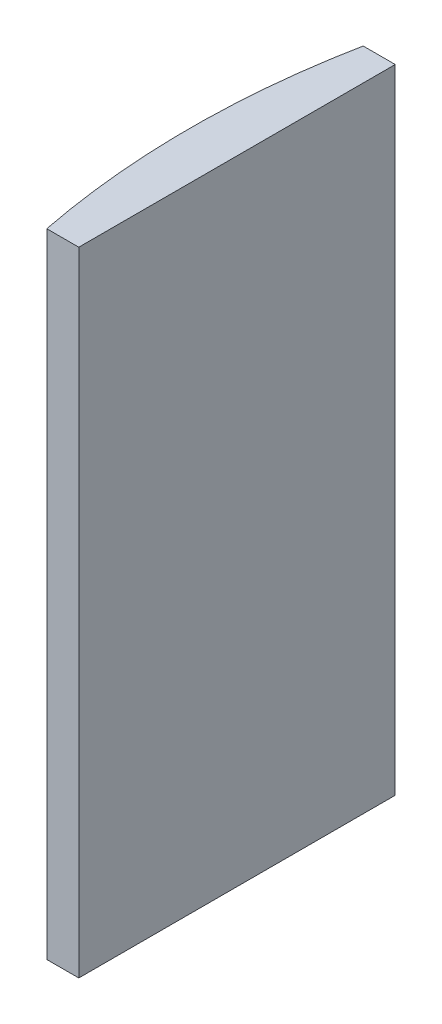
ISO-10303-21;
HEADER;
FILE_DESCRIPTION(('STEP AP214'),'2;1');
FILE_NAME('part.step','',(''),(''),'','','');
FILE_SCHEMA(('AUTOMOTIVE_DESIGN { 1 0 10303 214 1 1 1 1 }'));
ENDSEC;
DATA;
#1=APPLICATION_CONTEXT('core data for automotive mechanical design processes');
#2=APPLICATION_PROTOCOL_DEFINITION('international standard','automotive_design',2000,#1);
#3=PRODUCT_CONTEXT('',#1,'mechanical');
#4=PRODUCT('Part','Part','',(#3));
#5=PRODUCT_RELATED_PRODUCT_CATEGORY('part','',(#4));
#6=PRODUCT_DEFINITION_FORMATION('','',#4);
#7=PRODUCT_DEFINITION_CONTEXT('part definition',#1,'design');
#8=PRODUCT_DEFINITION('design','',#6,#7);
#9=PRODUCT_DEFINITION_SHAPE('','',#8);
#10=(LENGTH_UNIT() NAMED_UNIT(*) SI_UNIT(.MILLI.,.METRE.));
#11=(NAMED_UNIT(*) PLANE_ANGLE_UNIT() SI_UNIT($,.RADIAN.));
#12=(NAMED_UNIT(*) SI_UNIT($,.STERADIAN.) SOLID_ANGLE_UNIT());
#13=UNCERTAINTY_MEASURE_WITH_UNIT(LENGTH_MEASURE(1.E-05),#10,'distance_accuracy_value','');
#14=(GEOMETRIC_REPRESENTATION_CONTEXT(3) GLOBAL_UNCERTAINTY_ASSIGNED_CONTEXT((#13)) GLOBAL_UNIT_ASSIGNED_CONTEXT((#10,
#11,#12)) REPRESENTATION_CONTEXT('',''));
#15=CARTESIAN_POINT('',(0.,0.,0.));
#16=DIRECTION('',(0.,0.,1.));
#17=DIRECTION('',(1.,0.,0.));
#18=AXIS2_PLACEMENT_3D('',#15,#16,#17);
#19=CARTESIAN_POINT('',(4.35520433485127,60.,0.));
#20=DIRECTION('',(0.,-1.,0.));
#21=DIRECTION('',(0.,0.,-1.));
#22=AXIS2_PLACEMENT_3D('',#19,#20,#21);
#23=CYLINDRICAL_SURFACE('',#22,77.55);
#24=CARTESIAN_POINT('',(4.35520433485127,0.,0.));
#25=DIRECTION('',(0.,1.,0.));
#26=DIRECTION('',(0.,0.,1.));
#27=AXIS2_PLACEMENT_3D('',#24,#25,#26);
#28=CIRCLE('',#27,77.55);
#29=CARTESIAN_POINT('',(-71.7302903405466,0.,-15.));
#30=VERTEX_POINT('',#29);
#31=CARTESIAN_POINT('',(-71.7302903405466,0.,15.));
#32=VERTEX_POINT('',#31);
#33=EDGE_CURVE('E100',#30,#32,#28,.T.);
#34=ORIENTED_EDGE('',*,*,#33,.T.);
#35=DIRECTION('',(0.,-1.,0.));
#36=VECTOR('',#35,1.);
#37=CARTESIAN_POINT('',(-71.7302903405466,60.,15.));
#38=LINE('',#37,#36);
#39=CARTESIAN_POINT('',(-71.7302903405466,60.,15.));
#40=VERTEX_POINT('',#39);
#41=EDGE_CURVE('E11',#40,#32,#38,.T.);
#42=ORIENTED_EDGE('',*,*,#41,.F.);
#43=CARTESIAN_POINT('',(4.35520433485127,60.,0.));
#44=DIRECTION('',(0.,1.,0.));
#45=DIRECTION('',(0.,0.,1.));
#46=AXIS2_PLACEMENT_3D('',#43,#44,#45);
#47=CIRCLE('',#46,77.55);
#48=CARTESIAN_POINT('',(-71.7302903405466,60.,-15.));
#49=VERTEX_POINT('',#48);
#50=EDGE_CURVE('E88',#49,#40,#47,.T.);
#51=ORIENTED_EDGE('',*,*,#50,.F.);
#52=DIRECTION('',(0.,-1.,0.));
#53=VECTOR('',#52,1.);
#54=CARTESIAN_POINT('',(-71.7302903405466,60.,-15.));
#55=LINE('',#54,#53);
#56=EDGE_CURVE('E96',#49,#30,#55,.T.);
#57=ORIENTED_EDGE('',*,*,#56,.T.);
#58=EDGE_LOOP('',(#34,#42,#51,#57));
#59=FACE_BOUND('',#58,.T.);
#60=ADVANCED_FACE('F37',(#59),#23,.T.);
#61=CARTESIAN_POINT('',(-71.7302903405466,60.,15.));
#62=DIRECTION('',(0.,0.,-1.));
#63=DIRECTION('',(-1.,0.,0.));
#64=AXIS2_PLACEMENT_3D('',#61,#62,#63);
#65=PLANE('',#64);
#66=DIRECTION('',(1.,0.,0.));
#67=VECTOR('',#66,1.);
#68=CARTESIAN_POINT('',(-71.7302903405466,0.,15.));
#69=LINE('',#68,#67);
#70=CARTESIAN_POINT('',(-68.6947956651487,0.,15.));
#71=VERTEX_POINT('',#70);
#72=EDGE_CURVE('E92',#32,#71,#69,.T.);
#73=ORIENTED_EDGE('',*,*,#72,.T.);
#74=DIRECTION('',(0.,-1.,0.));
#75=VECTOR('',#74,1.);
#76=CARTESIAN_POINT('',(-68.6947956651487,60.,15.));
#77=LINE('',#76,#75);
#78=CARTESIAN_POINT('',(-68.6947956651487,60.,15.));
#79=VERTEX_POINT('',#78);
#80=EDGE_CURVE('E45',#79,#71,#77,.T.);
#81=ORIENTED_EDGE('',*,*,#80,.F.);
#82=DIRECTION('',(1.,0.,0.));
#83=VECTOR('',#82,1.);
#84=CARTESIAN_POINT('',(-71.7302903405466,60.,15.));
#85=LINE('',#84,#83);
#86=EDGE_CURVE('E83',#40,#79,#85,.T.);
#87=ORIENTED_EDGE('',*,*,#86,.F.);
#88=ORIENTED_EDGE('',*,*,#41,.T.);
#89=EDGE_LOOP('',(#73,#81,#87,#88));
#90=FACE_BOUND('',#89,.T.);
#91=ADVANCED_FACE('F91',(#90),#65,.F.);
#92=CARTESIAN_POINT('',(-68.6947956651487,60.,-15.));
#93=DIRECTION('',(-1.,0.,0.));
#94=DIRECTION('',(0.,0.,1.));
#95=AXIS2_PLACEMENT_3D('',#92,#93,#94);
#96=PLANE('',#95);
#97=DIRECTION('',(0.,0.,-1.));
#98=VECTOR('',#97,1.);
#99=CARTESIAN_POINT('',(-68.6947956651487,0.,-15.));
#100=LINE('',#99,#98);
#101=CARTESIAN_POINT('',(-68.6947956651487,0.,-15.));
#102=VERTEX_POINT('',#101);
#103=EDGE_CURVE('E70',#71,#102,#100,.T.);
#104=ORIENTED_EDGE('',*,*,#103,.T.);
#105=DIRECTION('',(0.,-1.,0.));
#106=VECTOR('',#105,1.);
#107=CARTESIAN_POINT('',(-68.6947956651487,60.,-15.));
#108=LINE('',#107,#106);
#109=CARTESIAN_POINT('',(-68.6947956651487,60.,-15.));
#110=VERTEX_POINT('',#109);
#111=EDGE_CURVE('E93',#110,#102,#108,.T.);
#112=ORIENTED_EDGE('',*,*,#111,.F.);
#113=DIRECTION('',(0.,0.,-1.));
#114=VECTOR('',#113,1.);
#115=CARTESIAN_POINT('',(-68.6947956651487,60.,-15.));
#116=LINE('',#115,#114);
#117=EDGE_CURVE('E86',#79,#110,#116,.T.);
#118=ORIENTED_EDGE('',*,*,#117,.F.);
#119=ORIENTED_EDGE('',*,*,#80,.T.);
#120=EDGE_LOOP('',(#104,#112,#118,#119));
#121=FACE_BOUND('',#120,.T.);
#122=ADVANCED_FACE('F94',(#121),#96,.F.);
#123=CARTESIAN_POINT('',(-71.7302903405466,60.,-15.));
#124=DIRECTION('',(0.,0.,1.));
#125=DIRECTION('',(1.,0.,0.));
#126=AXIS2_PLACEMENT_3D('',#123,#124,#125);
#127=PLANE('',#126);
#128=DIRECTION('',(-1.,0.,0.));
#129=VECTOR('',#128,1.);
#130=CARTESIAN_POINT('',(-71.7302903405466,0.,-15.));
#131=LINE('',#130,#129);
#132=EDGE_CURVE('E76',#102,#30,#131,.T.);
#133=ORIENTED_EDGE('',*,*,#132,.T.);
#134=ORIENTED_EDGE('',*,*,#56,.F.);
#135=DIRECTION('',(-1.,0.,0.));
#136=VECTOR('',#135,1.);
#137=CARTESIAN_POINT('',(-71.7302903405466,60.,-15.));
#138=LINE('',#137,#136);
#139=EDGE_CURVE('E53',#110,#49,#138,.T.);
#140=ORIENTED_EDGE('',*,*,#139,.F.);
#141=ORIENTED_EDGE('',*,*,#111,.T.);
#142=EDGE_LOOP('',(#133,#134,#140,#141));
#143=FACE_BOUND('',#142,.T.);
#144=ADVANCED_FACE('F107',(#143),#127,.F.);
#145=CARTESIAN_POINT('',(4.35520433485127,60.,0.));
#146=DIRECTION('',(0.,1.,0.));
#147=DIRECTION('',(0.,0.,1.));
#148=AXIS2_PLACEMENT_3D('',#145,#146,#147);
#149=PLANE('',#148);
#150=ORIENTED_EDGE('',*,*,#50,.T.);
#151=ORIENTED_EDGE('',*,*,#86,.T.);
#152=ORIENTED_EDGE('',*,*,#117,.T.);
#153=ORIENTED_EDGE('',*,*,#139,.T.);
#154=EDGE_LOOP('',(#150,#151,#152,#153));
#155=FACE_BOUND('',#154,.T.);
#156=ADVANCED_FACE('F84',(#155),#149,.T.);
#157=CARTESIAN_POINT('',(4.35520433485127,0.,0.));
#158=DIRECTION('',(0.,1.,0.));
#159=DIRECTION('',(0.,0.,1.));
#160=AXIS2_PLACEMENT_3D('',#157,#158,#159);
#161=PLANE('',#160);
#162=ORIENTED_EDGE('',*,*,#33,.F.);
#163=ORIENTED_EDGE('',*,*,#132,.F.);
#164=ORIENTED_EDGE('',*,*,#103,.F.);
#165=ORIENTED_EDGE('',*,*,#72,.F.);
#166=EDGE_LOOP('',(#162,#163,#164,#165));
#167=FACE_BOUND('',#166,.T.);
#168=ADVANCED_FACE('F110',(#167),#161,.F.);
#169=CLOSED_SHELL('',(#60,#91,#122,#144,#156,#168));
#170=MANIFOLD_SOLID_BREP('B2',#169);
#171=ADVANCED_BREP_SHAPE_REPRESENTATION('',(#18,#170),#14);
#172=SHAPE_DEFINITION_REPRESENTATION(#9,#171);
ENDSEC;
END-ISO-10303-21;
